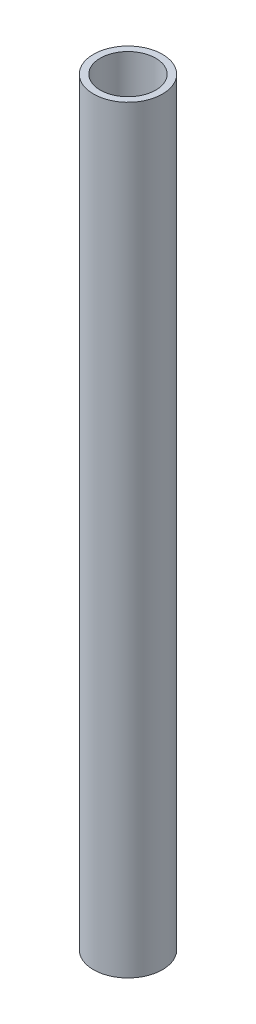
ISO-10303-21;
HEADER;
FILE_DESCRIPTION(('STEP AP214'),'2;1');
FILE_NAME('part.step','',(''),(''),'','','');
FILE_SCHEMA(('AUTOMOTIVE_DESIGN { 1 0 10303 214 1 1 1 1 }'));
ENDSEC;
DATA;
#1=APPLICATION_CONTEXT('core data for automotive mechanical design processes');
#2=APPLICATION_PROTOCOL_DEFINITION('international standard','automotive_design',2000,#1);
#3=PRODUCT_CONTEXT('',#1,'mechanical');
#4=PRODUCT('Part','Part','',(#3));
#5=PRODUCT_RELATED_PRODUCT_CATEGORY('part','',(#4));
#6=PRODUCT_DEFINITION_FORMATION('','',#4);
#7=PRODUCT_DEFINITION_CONTEXT('part definition',#1,'design');
#8=PRODUCT_DEFINITION('design','',#6,#7);
#9=PRODUCT_DEFINITION_SHAPE('','',#8);
#10=(LENGTH_UNIT() NAMED_UNIT(*) SI_UNIT(.MILLI.,.METRE.));
#11=(NAMED_UNIT(*) PLANE_ANGLE_UNIT() SI_UNIT($,.RADIAN.));
#12=(NAMED_UNIT(*) SI_UNIT($,.STERADIAN.) SOLID_ANGLE_UNIT());
#13=UNCERTAINTY_MEASURE_WITH_UNIT(LENGTH_MEASURE(1.E-05),#10,'distance_accuracy_value','');
#14=(GEOMETRIC_REPRESENTATION_CONTEXT(3) GLOBAL_UNCERTAINTY_ASSIGNED_CONTEXT((#13)) GLOBAL_UNIT_ASSIGNED_CONTEXT((#10,
#11,#12)) REPRESENTATION_CONTEXT('',''));
#15=CARTESIAN_POINT('',(0.,0.,0.));
#16=DIRECTION('',(0.,0.,1.));
#17=DIRECTION('',(1.,0.,0.));
#18=AXIS2_PLACEMENT_3D('',#15,#16,#17);
#19=CARTESIAN_POINT('',(0.,139.7,0.));
#20=DIRECTION('',(0.,1.,0.));
#21=DIRECTION('',(0.,0.,1.));
#22=AXIS2_PLACEMENT_3D('',#19,#20,#21);
#23=PLANE('',#22);
#24=CARTESIAN_POINT('',(0.,139.7,0.));
#25=DIRECTION('',(0.,1.,0.));
#26=DIRECTION('',(0.,0.,1.));
#27=AXIS2_PLACEMENT_3D('',#24,#25,#26);
#28=CIRCLE('',#27,6.35);
#29=CARTESIAN_POINT('',(0.,139.7,6.35));
#30=VERTEX_POINT('',#29);
#31=EDGE_CURVE('E10',#30,#30,#28,.T.);
#32=ORIENTED_EDGE('',*,*,#31,.T.);
#33=EDGE_LOOP('',(#32));
#34=FACE_BOUND('',#33,.T.);
#35=CARTESIAN_POINT('',(0.,139.7,0.));
#36=DIRECTION('',(0.,1.,0.));
#37=DIRECTION('',(0.,0.,1.));
#38=AXIS2_PLACEMENT_3D('',#35,#36,#37);
#39=CIRCLE('',#38,5.1054);
#40=CARTESIAN_POINT('',(0.,139.7,5.1054));
#41=VERTEX_POINT('',#40);
#42=EDGE_CURVE('E53',#41,#41,#39,.T.);
#43=ORIENTED_EDGE('',*,*,#42,.F.);
#44=EDGE_LOOP('',(#43));
#45=FACE_BOUND('',#44,.T.);
#46=ADVANCED_FACE('F39',(#34,#45),#23,.T.);
#47=CARTESIAN_POINT('',(0.,0.,0.));
#48=DIRECTION('',(0.,1.,0.));
#49=DIRECTION('',(0.,0.,1.));
#50=AXIS2_PLACEMENT_3D('',#47,#48,#49);
#51=PLANE('',#50);
#52=CARTESIAN_POINT('',(0.,0.,0.));
#53=DIRECTION('',(0.,1.,0.));
#54=DIRECTION('',(0.,0.,1.));
#55=AXIS2_PLACEMENT_3D('',#52,#53,#54);
#56=CIRCLE('',#55,6.35);
#57=CARTESIAN_POINT('',(0.,0.,6.35));
#58=VERTEX_POINT('',#57);
#59=EDGE_CURVE('E43',#58,#58,#56,.T.);
#60=ORIENTED_EDGE('',*,*,#59,.F.);
#61=EDGE_LOOP('',(#60));
#62=FACE_BOUND('',#61,.T.);
#63=CARTESIAN_POINT('',(0.,0.,0.));
#64=DIRECTION('',(0.,1.,0.));
#65=DIRECTION('',(0.,0.,1.));
#66=AXIS2_PLACEMENT_3D('',#63,#64,#65);
#67=CIRCLE('',#66,5.1054);
#68=CARTESIAN_POINT('',(0.,0.,5.1054));
#69=VERTEX_POINT('',#68);
#70=EDGE_CURVE('E55',#69,#69,#67,.T.);
#71=ORIENTED_EDGE('',*,*,#70,.T.);
#72=EDGE_LOOP('',(#71));
#73=FACE_BOUND('',#72,.T.);
#74=ADVANCED_FACE('F68',(#62,#73),#51,.F.);
#75=CARTESIAN_POINT('',(0.,139.7,0.));
#76=DIRECTION('',(0.,-1.,0.));
#77=DIRECTION('',(0.,0.,-1.));
#78=AXIS2_PLACEMENT_3D('',#75,#76,#77);
#79=CYLINDRICAL_SURFACE('',#78,6.35);
#80=ORIENTED_EDGE('',*,*,#31,.F.);
#81=EDGE_LOOP('',(#80));
#82=FACE_BOUND('',#81,.T.);
#83=ORIENTED_EDGE('',*,*,#59,.T.);
#84=EDGE_LOOP('',(#83));
#85=FACE_BOUND('',#84,.T.);
#86=ADVANCED_FACE('F41',(#82,#85),#79,.T.);
#87=CARTESIAN_POINT('',(0.,139.7,0.));
#88=DIRECTION('',(0.,-1.,0.));
#89=DIRECTION('',(0.,0.,-1.));
#90=AXIS2_PLACEMENT_3D('',#87,#88,#89);
#91=CYLINDRICAL_SURFACE('',#90,5.1054);
#92=ORIENTED_EDGE('',*,*,#42,.T.);
#93=EDGE_LOOP('',(#92));
#94=FACE_BOUND('',#93,.T.);
#95=ORIENTED_EDGE('',*,*,#70,.F.);
#96=EDGE_LOOP('',(#95));
#97=FACE_BOUND('',#96,.T.);
#98=ADVANCED_FACE('F64',(#94,#97),#91,.F.);
#99=CLOSED_SHELL('',(#46,#74,#86,#98));
#100=MANIFOLD_SOLID_BREP('B2',#99);
#101=ADVANCED_BREP_SHAPE_REPRESENTATION('',(#18,#100),#14);
#102=SHAPE_DEFINITION_REPRESENTATION(#9,#101);
ENDSEC;
END-ISO-10303-21;
